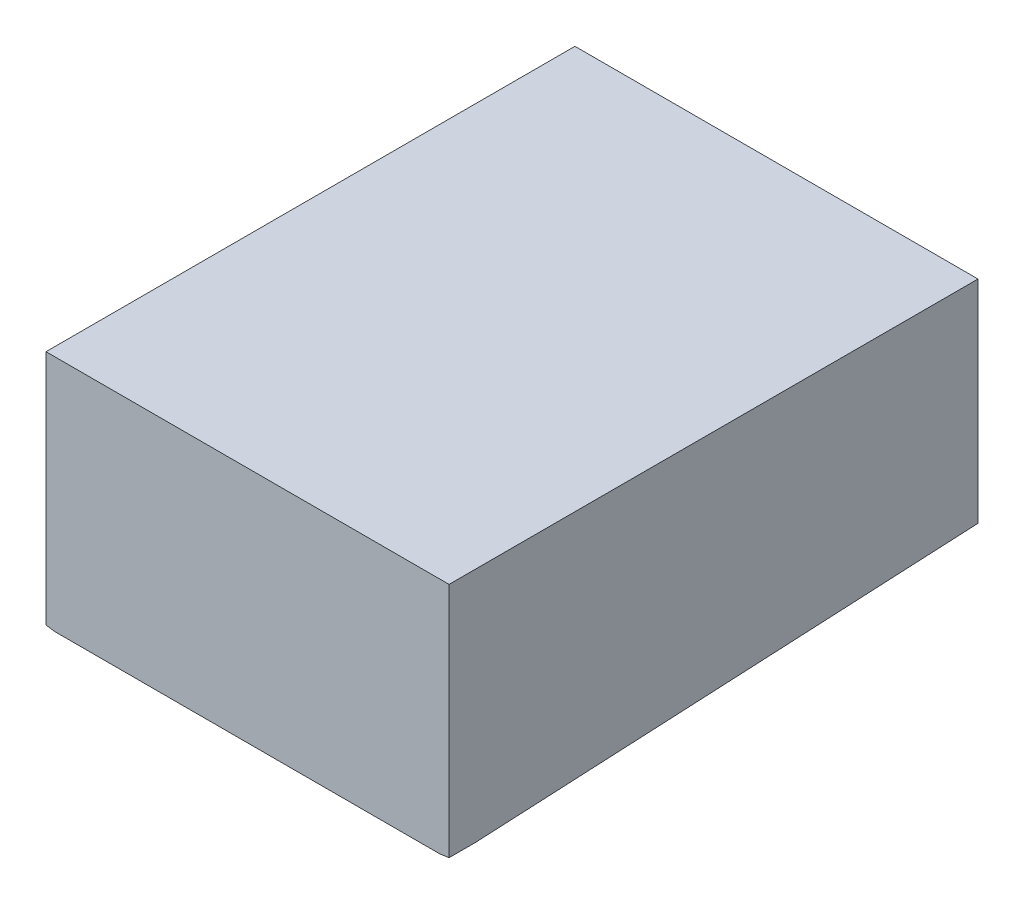
ISO-10303-21;
HEADER;
FILE_DESCRIPTION(('STEP AP214'),'2;1');
FILE_NAME('part.step','',(''),(''),'','','');
FILE_SCHEMA(('AUTOMOTIVE_DESIGN { 1 0 10303 214 1 1 1 1 }'));
ENDSEC;
DATA;
#1=APPLICATION_CONTEXT('core data for automotive mechanical design processes');
#2=APPLICATION_PROTOCOL_DEFINITION('international standard','automotive_design',2000,#1);
#3=PRODUCT_CONTEXT('',#1,'mechanical');
#4=PRODUCT('Part','Part','',(#3));
#5=PRODUCT_RELATED_PRODUCT_CATEGORY('part','',(#4));
#6=PRODUCT_DEFINITION_FORMATION('','',#4);
#7=PRODUCT_DEFINITION_CONTEXT('part definition',#1,'design');
#8=PRODUCT_DEFINITION('design','',#6,#7);
#9=PRODUCT_DEFINITION_SHAPE('','',#8);
#10=(LENGTH_UNIT() NAMED_UNIT(*) SI_UNIT(.MILLI.,.METRE.));
#11=(NAMED_UNIT(*) PLANE_ANGLE_UNIT() SI_UNIT($,.RADIAN.));
#12=(NAMED_UNIT(*) SI_UNIT($,.STERADIAN.) SOLID_ANGLE_UNIT());
#13=UNCERTAINTY_MEASURE_WITH_UNIT(LENGTH_MEASURE(1.E-05),#10,'distance_accuracy_value','');
#14=(GEOMETRIC_REPRESENTATION_CONTEXT(3) GLOBAL_UNCERTAINTY_ASSIGNED_CONTEXT((#13)) GLOBAL_UNIT_ASSIGNED_CONTEXT((#10,
#11,#12)) REPRESENTATION_CONTEXT('',''));
#15=CARTESIAN_POINT('',(0.,0.,0.));
#16=DIRECTION('',(0.,0.,1.));
#17=DIRECTION('',(1.,0.,0.));
#18=AXIS2_PLACEMENT_3D('',#15,#16,#17);
#19=CARTESIAN_POINT('',(0.,0.,-200.));
#20=DIRECTION('',(0.,0.,1.));
#21=DIRECTION('',(-1.,0.,0.));
#22=AXIS2_PLACEMENT_3D('',#19,#20,#21);
#23=ELLIPSE('',#22,244.,110.);
#24=DIRECTION('',(0.,0.,1.));
#25=VECTOR('',#24,1.);
#26=SURFACE_OF_LINEAR_EXTRUSION('',#23,#25);
#27=CARTESIAN_POINT('',(-72.7279545422587,-105.,0.));
#28=CARTESIAN_POINT('',(-72.9253664099445,-104.972209807955,-0.555803840908261));
#29=CARTESIAN_POINT('',(-73.1219950898908,-104.944405747347,-1.11188505306019));
#30=CARTESIAN_POINT('',(-73.513713959438,-104.888771057162,-2.22457885675265));
#31=CARTESIAN_POINT('',(-73.7088041709151,-104.860940427969,-2.78119144061071));
#32=CARTESIAN_POINT('',(-74.0974782892747,-104.805253166378,-3.89493667244371));
#33=CARTESIAN_POINT('',(-74.2910622063948,-104.777396534157,-4.45206931685512));
#34=CARTESIAN_POINT('',(-74.676754400302,-104.721657819251,-5.56684361498339));
#35=CARTESIAN_POINT('',(-74.8688626776556,-104.693775736575,-6.12448526850475));
#36=CARTESIAN_POINT('',(-75.2516336307347,-104.637986615257,-7.24026769485571));
#37=CARTESIAN_POINT('',(-75.4422962960614,-104.610079576438,-7.79840847124345));
#38=CARTESIAN_POINT('',(-75.8222046808485,-104.554241028383,-8.91517943234842));
#39=CARTESIAN_POINT('',(-76.0114503807681,-104.526309518815,-9.47380962369673));
#40=CARTESIAN_POINT('',(-76.1999999999996,-104.498366300756,-10.0326739848758));
#41=B_SPLINE_CURVE_WITH_KNOTS('',3,(#27,#28,#29,#30,#31,#32,#33,#34,#35,#36,#37,#38,#39,#40),
.UNSPECIFIED.,.F.,.F.,(4,2,2,2,2,2,4),(0.,1.77142661138509,3.54282798836431,5.31421731526618,
7.08560596206886,8.85700733898648,10.628433099745),.UNSPECIFIED.);
#42=CARTESIAN_POINT('',(-72.7279545422586,-105.,0.));
#43=VERTEX_POINT('',#42);
#44=CARTESIAN_POINT('',(-76.2,-104.498366300756,-10.0326739848769));
#45=VERTEX_POINT('',#44);
#46=EDGE_CURVE('E136',#43,#45,#41,.T.);
#47=ORIENTED_EDGE('',*,*,#46,.F.);
#48=CARTESIAN_POINT('',(0.,0.,0.));
#49=DIRECTION('',(0.,0.,1.));
#50=DIRECTION('',(-1.,0.,0.));
#51=AXIS2_PLACEMENT_3D('',#48,#49,#50);
#52=ELLIPSE('',#51,244.,110.);
#53=CARTESIAN_POINT('',(-76.1999999999996,-104.498366300756,0.));
#54=VERTEX_POINT('',#53);
#55=EDGE_CURVE('E103',#54,#43,#52,.T.);
#56=ORIENTED_EDGE('',*,*,#55,.F.);
#57=DIRECTION('',(0.,0.,1.));
#58=VECTOR('',#57,1.);
#59=CARTESIAN_POINT('',(-76.1999999999996,-104.498366300756,-200.));
#60=LINE('',#59,#58);
#61=EDGE_CURVE('E88',#45,#54,#60,.T.);
#62=ORIENTED_EDGE('',*,*,#61,.F.);
#63=EDGE_LOOP('',(#47,#56,#62));
#64=FACE_BOUND('',#63,.T.);
#65=ADVANCED_FACE('F35',(#64),#26,.T.);
#66=CARTESIAN_POINT('',(-76.2,-15.,-200.));
#67=DIRECTION('',(-1.,0.,0.));
#68=DIRECTION('',(0.,-1.,0.));
#69=AXIS2_PLACEMENT_3D('',#66,#67,#68);
#70=PLANE('',#69);
#71=DIRECTION('',(0.,-0.0499376169438922,0.998752338877845));
#72=VECTOR('',#71,1.);
#73=CARTESIAN_POINT('',(-76.2,-95.,-200.));
#74=LINE('',#73,#72);
#75=CARTESIAN_POINT('',(-76.2,-95.,-200.));
#76=VERTEX_POINT('',#75);
#77=EDGE_CURVE('E129',#76,#45,#74,.T.);
#78=ORIENTED_EDGE('',*,*,#77,.T.);
#79=ORIENTED_EDGE('',*,*,#61,.T.);
#80=DIRECTION('',(0.,-1.,0.));
#81=VECTOR('',#80,1.);
#82=CARTESIAN_POINT('',(-76.2,-15.,0.));
#83=LINE('',#82,#81);
#84=CARTESIAN_POINT('',(-76.2,-15.,0.));
#85=VERTEX_POINT('',#84);
#86=EDGE_CURVE('E85',#85,#54,#83,.T.);
#87=ORIENTED_EDGE('',*,*,#86,.F.);
#88=DIRECTION('',(0.,0.,1.));
#89=VECTOR('',#88,1.);
#90=CARTESIAN_POINT('',(-76.2,-15.,-200.));
#91=LINE('',#90,#89);
#92=CARTESIAN_POINT('',(-76.2,-15.,-200.));
#93=VERTEX_POINT('',#92);
#94=EDGE_CURVE('E43',#93,#85,#91,.T.);
#95=ORIENTED_EDGE('',*,*,#94,.F.);
#96=DIRECTION('',(0.,-1.,0.));
#97=VECTOR('',#96,1.);
#98=CARTESIAN_POINT('',(-76.2,-15.,-200.));
#99=LINE('',#98,#97);
#100=EDGE_CURVE('E99',#93,#76,#99,.T.);
#101=ORIENTED_EDGE('',*,*,#100,.T.);
#102=EDGE_LOOP('',(#78,#79,#87,#95,#101));
#103=FACE_BOUND('',#102,.T.);
#104=ADVANCED_FACE('F37',(#103),#70,.T.);
#105=CARTESIAN_POINT('',(-76.2,-15.,-200.));
#106=DIRECTION('',(0.,1.,0.));
#107=DIRECTION('',(-1.,0.,0.));
#108=AXIS2_PLACEMENT_3D('',#105,#106,#107);
#109=PLANE('',#108);
#110=DIRECTION('',(-1.,0.,0.));
#111=VECTOR('',#110,1.);
#112=CARTESIAN_POINT('',(-76.2,-15.,0.));
#113=LINE('',#112,#111);
#114=CARTESIAN_POINT('',(76.2,-15.,0.));
#115=VERTEX_POINT('',#114);
#116=EDGE_CURVE('E79',#115,#85,#113,.T.);
#117=ORIENTED_EDGE('',*,*,#116,.F.);
#118=DIRECTION('',(0.,0.,1.));
#119=VECTOR('',#118,1.);
#120=CARTESIAN_POINT('',(76.2,-15.,-200.));
#121=LINE('',#120,#119);
#122=CARTESIAN_POINT('',(76.2,-15.,-200.));
#123=VERTEX_POINT('',#122);
#124=EDGE_CURVE('E82',#123,#115,#121,.T.);
#125=ORIENTED_EDGE('',*,*,#124,.F.);
#126=DIRECTION('',(-1.,0.,0.));
#127=VECTOR('',#126,1.);
#128=CARTESIAN_POINT('',(-76.2,-15.,-200.));
#129=LINE('',#128,#127);
#130=EDGE_CURVE('E81',#123,#93,#129,.T.);
#131=ORIENTED_EDGE('',*,*,#130,.T.);
#132=ORIENTED_EDGE('',*,*,#94,.T.);
#133=EDGE_LOOP('',(#117,#125,#131,#132));
#134=FACE_BOUND('',#133,.T.);
#135=ADVANCED_FACE('F76',(#134),#109,.T.);
#136=CARTESIAN_POINT('',(76.2,-15.,-200.));
#137=DIRECTION('',(1.,0.,0.));
#138=DIRECTION('',(0.,1.,0.));
#139=AXIS2_PLACEMENT_3D('',#136,#137,#138);
#140=PLANE('',#139);
#141=DIRECTION('',(0.,-0.0499376169438922,0.998752338877845));
#142=VECTOR('',#141,1.);
#143=CARTESIAN_POINT('',(76.2,-95.,-200.));
#144=LINE('',#143,#142);
#145=CARTESIAN_POINT('',(76.2,-95.,-200.));
#146=VERTEX_POINT('',#145);
#147=CARTESIAN_POINT('',(76.2,-104.498366300756,-10.0326739848769));
#148=VERTEX_POINT('',#147);
#149=EDGE_CURVE('E217',#146,#148,#144,.T.);
#150=ORIENTED_EDGE('',*,*,#149,.F.);
#151=DIRECTION('',(0.,1.,0.));
#152=VECTOR('',#151,1.);
#153=CARTESIAN_POINT('',(76.2,-15.,-200.));
#154=LINE('',#153,#152);
#155=EDGE_CURVE('E101',#146,#123,#154,.T.);
#156=ORIENTED_EDGE('',*,*,#155,.T.);
#157=ORIENTED_EDGE('',*,*,#124,.T.);
#158=DIRECTION('',(0.,1.,0.));
#159=VECTOR('',#158,1.);
#160=CARTESIAN_POINT('',(76.2,-15.,0.));
#161=LINE('',#160,#159);
#162=CARTESIAN_POINT('',(76.1999999999996,-104.498366300756,0.));
#163=VERTEX_POINT('',#162);
#164=EDGE_CURVE('E98',#163,#115,#161,.T.);
#165=ORIENTED_EDGE('',*,*,#164,.F.);
#166=DIRECTION('',(0.,0.,1.));
#167=VECTOR('',#166,1.);
#168=CARTESIAN_POINT('',(76.1999999999996,-104.498366300756,-200.));
#169=LINE('',#168,#167);
#170=EDGE_CURVE('E108',#148,#163,#169,.T.);
#171=ORIENTED_EDGE('',*,*,#170,.F.);
#172=EDGE_LOOP('',(#150,#156,#157,#165,#171));
#173=FACE_BOUND('',#172,.T.);
#174=ADVANCED_FACE('F118',(#173),#140,.T.);
#175=CARTESIAN_POINT('',(76.1999999999996,-104.498366300756,-10.0326739848758));
#176=CARTESIAN_POINT('',(76.0114503807681,-104.526309518815,-9.47380962369675));
#177=CARTESIAN_POINT('',(75.8222046808485,-104.554241028383,-8.91517943234844));
#178=CARTESIAN_POINT('',(75.4422962960614,-104.610079576438,-7.79840847124347));
#179=CARTESIAN_POINT('',(75.2516336307347,-104.637986615257,-7.24026769485572));
#180=CARTESIAN_POINT('',(74.8688626776556,-104.693775736575,-6.12448526850475));
#181=CARTESIAN_POINT('',(74.676754400302,-104.721657819251,-5.5668436149834));
#182=CARTESIAN_POINT('',(74.2910622063948,-104.777396534157,-4.45206931685513));
#183=CARTESIAN_POINT('',(74.0974782892747,-104.805253166378,-3.89493667244371));
#184=CARTESIAN_POINT('',(73.7088041709152,-104.860940427969,-2.7811914406107));
#185=CARTESIAN_POINT('',(73.513713959438,-104.888771057162,-2.22457885675263));
#186=CARTESIAN_POINT('',(73.1219950898908,-104.944405747347,-1.11188505306018));
#187=CARTESIAN_POINT('',(72.9253664099444,-104.972209807955,-0.555803840908263));
#188=CARTESIAN_POINT('',(72.7279545422586,-105.,0.));
#189=B_SPLINE_CURVE_WITH_KNOTS('',3,(#175,#176,#177,#178,#179,#180,#181,#182,#183,#184,#185,
#186,#187,#188),.UNSPECIFIED.,.F.,.F.,(4,2,2,2,2,2,4),(0.,1.77142576075853,3.54282713767615,
5.31421578447884,7.08560511138072,8.85700648835995,10.628433099745),.UNSPECIFIED.);
#190=CARTESIAN_POINT('',(72.7279545422586,-105.,0.));
#191=VERTEX_POINT('',#190);
#192=EDGE_CURVE('E49',#148,#191,#189,.T.);
#193=ORIENTED_EDGE('',*,*,#192,.F.);
#194=ORIENTED_EDGE('',*,*,#170,.T.);
#195=EDGE_CURVE('E92',#191,#163,#52,.T.);
#196=ORIENTED_EDGE('',*,*,#195,.F.);
#197=EDGE_LOOP('',(#193,#194,#196));
#198=FACE_BOUND('',#197,.T.);
#199=ADVANCED_FACE('F150',(#198),#26,.T.);
#200=CARTESIAN_POINT('',(0.,0.,-200.));
#201=DIRECTION('',(0.,0.,1.));
#202=DIRECTION('',(1.,0.,0.));
#203=AXIS2_PLACEMENT_3D('',#200,#201,#202);
#204=PLANE('',#203);
#205=ORIENTED_EDGE('',*,*,#155,.F.);
#206=DIRECTION('',(1.,0.,0.));
#207=VECTOR('',#206,1.);
#208=CARTESIAN_POINT('',(-76.2,-95.,-200.));
#209=LINE('',#208,#207);
#210=EDGE_CURVE('E127',#76,#146,#209,.T.);
#211=ORIENTED_EDGE('',*,*,#210,.F.);
#212=ORIENTED_EDGE('',*,*,#100,.F.);
#213=ORIENTED_EDGE('',*,*,#130,.F.);
#214=EDGE_LOOP('',(#205,#211,#212,#213));
#215=FACE_BOUND('',#214,.T.);
#216=ADVANCED_FACE('F122',(#215),#204,.F.);
#217=CARTESIAN_POINT('',(0.,0.,0.));
#218=DIRECTION('',(0.,0.,1.));
#219=DIRECTION('',(1.,0.,0.));
#220=AXIS2_PLACEMENT_3D('',#217,#218,#219);
#221=PLANE('',#220);
#222=DIRECTION('',(-1.,0.,0.));
#223=VECTOR('',#222,1.);
#224=CARTESIAN_POINT('',(0.,-105.,0.));
#225=LINE('',#224,#223);
#226=EDGE_CURVE('E11',#191,#43,#225,.T.);
#227=ORIENTED_EDGE('',*,*,#226,.F.);
#228=ORIENTED_EDGE('',*,*,#195,.T.);
#229=ORIENTED_EDGE('',*,*,#164,.T.);
#230=ORIENTED_EDGE('',*,*,#116,.T.);
#231=ORIENTED_EDGE('',*,*,#86,.T.);
#232=ORIENTED_EDGE('',*,*,#55,.T.);
#233=EDGE_LOOP('',(#227,#228,#229,#230,#231,#232));
#234=FACE_BOUND('',#233,.T.);
#235=ADVANCED_FACE('F95',(#234),#221,.T.);
#236=CARTESIAN_POINT('',(-76.2,-95.,-200.));
#237=DIRECTION('',(0.,0.998752338877845,0.0499376169438922));
#238=DIRECTION('',(0.,-0.0499376169438922,0.998752338877845));
#239=AXIS2_PLACEMENT_3D('',#236,#237,#238);
#240=PLANE('',#239);
#241=ORIENTED_EDGE('',*,*,#192,.T.);
#242=ORIENTED_EDGE('',*,*,#226,.T.);
#243=ORIENTED_EDGE('',*,*,#46,.T.);
#244=ORIENTED_EDGE('',*,*,#77,.F.);
#245=ORIENTED_EDGE('',*,*,#210,.T.);
#246=ORIENTED_EDGE('',*,*,#149,.T.);
#247=EDGE_LOOP('',(#241,#242,#243,#244,#245,#246));
#248=FACE_BOUND('',#247,.T.);
#249=ADVANCED_FACE('F137',(#248),#240,.F.);
#250=CLOSED_SHELL('',(#65,#104,#135,#174,#199,#216,#235,#249));
#251=MANIFOLD_SOLID_BREP('B2',#250);
#252=ADVANCED_BREP_SHAPE_REPRESENTATION('',(#18,#251),#14);
#253=SHAPE_DEFINITION_REPRESENTATION(#9,#252);
ENDSEC;
END-ISO-10303-21;
